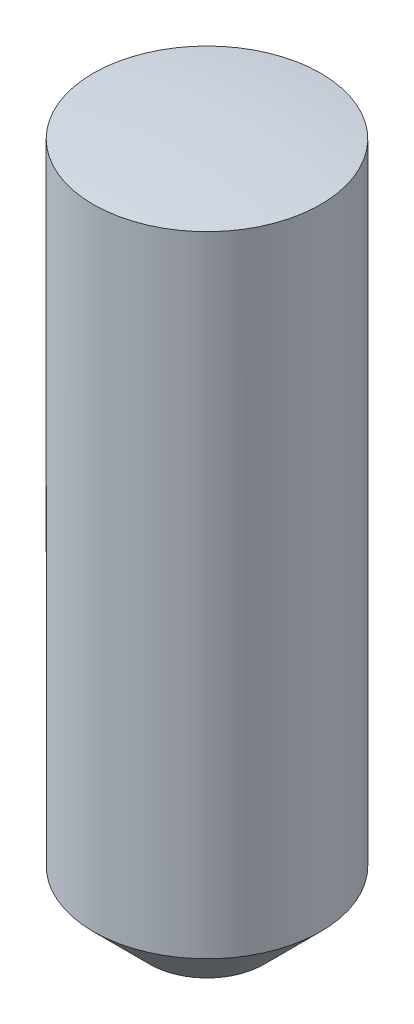
ISO-10303-21;
HEADER;
FILE_DESCRIPTION(('STEP AP214'),'2;1');
FILE_NAME('part.step','',(''),(''),'','','');
FILE_SCHEMA(('AUTOMOTIVE_DESIGN { 1 0 10303 214 1 1 1 1 }'));
ENDSEC;
DATA;
#1=APPLICATION_CONTEXT('core data for automotive mechanical design processes');
#2=APPLICATION_PROTOCOL_DEFINITION('international standard','automotive_design',2000,#1);
#3=PRODUCT_CONTEXT('',#1,'mechanical');
#4=PRODUCT('Part','Part','',(#3));
#5=PRODUCT_RELATED_PRODUCT_CATEGORY('part','',(#4));
#6=PRODUCT_DEFINITION_FORMATION('','',#4);
#7=PRODUCT_DEFINITION_CONTEXT('part definition',#1,'design');
#8=PRODUCT_DEFINITION('design','',#6,#7);
#9=PRODUCT_DEFINITION_SHAPE('','',#8);
#10=(LENGTH_UNIT() NAMED_UNIT(*) SI_UNIT(.MILLI.,.METRE.));
#11=(NAMED_UNIT(*) PLANE_ANGLE_UNIT() SI_UNIT($,.RADIAN.));
#12=(NAMED_UNIT(*) SI_UNIT($,.STERADIAN.) SOLID_ANGLE_UNIT());
#13=UNCERTAINTY_MEASURE_WITH_UNIT(LENGTH_MEASURE(1.E-05),#10,'distance_accuracy_value','');
#14=(GEOMETRIC_REPRESENTATION_CONTEXT(3) GLOBAL_UNCERTAINTY_ASSIGNED_CONTEXT((#13)) GLOBAL_UNIT_ASSIGNED_CONTEXT((#10,
#11,#12)) REPRESENTATION_CONTEXT('',''));
#15=CARTESIAN_POINT('',(0.,0.,0.));
#16=DIRECTION('',(0.,0.,1.));
#17=DIRECTION('',(1.,0.,0.));
#18=AXIS2_PLACEMENT_3D('',#15,#16,#17);
#19=CARTESIAN_POINT('',(0.,-6.1,0.));
#20=DIRECTION('',(0.,1.,0.));
#21=DIRECTION('',(0.,0.,1.));
#22=AXIS2_PLACEMENT_3D('',#19,#20,#21);
#23=CYLINDRICAL_SURFACE('',#22,1.);
#24=CARTESIAN_POINT('',(0.,-5.6,0.));
#25=DIRECTION('',(0.,1.,0.));
#26=DIRECTION('',(0.,0.,1.));
#27=AXIS2_PLACEMENT_3D('',#24,#25,#26);
#28=CIRCLE('',#27,1.);
#29=CARTESIAN_POINT('',(0.,-5.6,1.));
#30=VERTEX_POINT('',#29);
#31=EDGE_CURVE('E41',#30,#30,#28,.T.);
#32=ORIENTED_EDGE('',*,*,#31,.T.);
#33=EDGE_LOOP('',(#32));
#34=FACE_BOUND('',#33,.T.);
#35=CARTESIAN_POINT('',(0.,-0.0627460668062279,0.));
#36=DIRECTION('',(0.,-1.,0.));
#37=DIRECTION('',(0.,0.,-1.));
#38=AXIS2_PLACEMENT_3D('',#35,#36,#37);
#39=CIRCLE('',#38,1.);
#40=CARTESIAN_POINT('',(0.,-0.0627460668062279,-1.));
#41=VERTEX_POINT('',#40);
#42=EDGE_CURVE('E37',#41,#41,#39,.T.);
#43=ORIENTED_EDGE('',*,*,#42,.T.);
#44=EDGE_LOOP('',(#43));
#45=FACE_BOUND('',#44,.T.);
#46=ADVANCED_FACE('F33',(#34,#45),#23,.T.);
#47=CARTESIAN_POINT('',(0.,-6.1,0.));
#48=DIRECTION('',(0.,1.,0.));
#49=DIRECTION('',(0.,0.,1.));
#50=AXIS2_PLACEMENT_3D('',#47,#48,#49);
#51=PLANE('',#50);
#52=CARTESIAN_POINT('',(0.,-6.1,0.));
#53=DIRECTION('',(0.,1.,0.));
#54=DIRECTION('',(0.,0.,1.));
#55=AXIS2_PLACEMENT_3D('',#52,#53,#54);
#56=CIRCLE('',#55,0.5);
#57=CARTESIAN_POINT('',(0.,-6.1,0.5));
#58=VERTEX_POINT('',#57);
#59=EDGE_CURVE('E11',#58,#58,#56,.F.);
#60=ORIENTED_EDGE('',*,*,#59,.T.);
#61=EDGE_LOOP('',(#60));
#62=FACE_BOUND('',#61,.T.);
#63=ADVANCED_FACE('F57',(#62),#51,.F.);
#64=CARTESIAN_POINT('',(0.,-5.6,0.));
#65=DIRECTION('',(0.,1.,0.));
#66=DIRECTION('',(0.,0.,1.));
#67=AXIS2_PLACEMENT_3D('',#64,#65,#66);
#68=CONICAL_SURFACE('',#67,1.,0.78539816339745);
#69=ORIENTED_EDGE('',*,*,#59,.F.);
#70=EDGE_LOOP('',(#69));
#71=FACE_BOUND('',#70,.T.);
#72=ORIENTED_EDGE('',*,*,#31,.F.);
#73=EDGE_LOOP('',(#72));
#74=FACE_BOUND('',#73,.T.);
#75=ADVANCED_FACE('F35',(#71,#74),#68,.T.);
#76=CARTESIAN_POINT('',(0.,-8.,0.));
#77=DIRECTION('',(0.,-1.,0.));
#78=DIRECTION('',(-1.,0.,0.));
#79=AXIS2_PLACEMENT_3D('',#76,#77,#78);
#80=SPHERICAL_SURFACE('',#79,8.);
#81=CARTESIAN_POINT('',(0.,0.,0.));
#82=VERTEX_POINT('',#81);
#83=VERTEX_LOOP('',#82);
#84=FACE_BOUND('',#83,.T.);
#85=ORIENTED_EDGE('',*,*,#42,.F.);
#86=EDGE_LOOP('',(#85));
#87=FACE_BOUND('',#86,.T.);
#88=ADVANCED_FACE('F44',(#84,#87),#80,.T.);
#89=CLOSED_SHELL('',(#46,#63,#75,#88));
#90=MANIFOLD_SOLID_BREP('B2',#89);
#91=ADVANCED_BREP_SHAPE_REPRESENTATION('',(#18,#90),#14);
#92=SHAPE_DEFINITION_REPRESENTATION(#9,#91);
ENDSEC;
END-ISO-10303-21;
